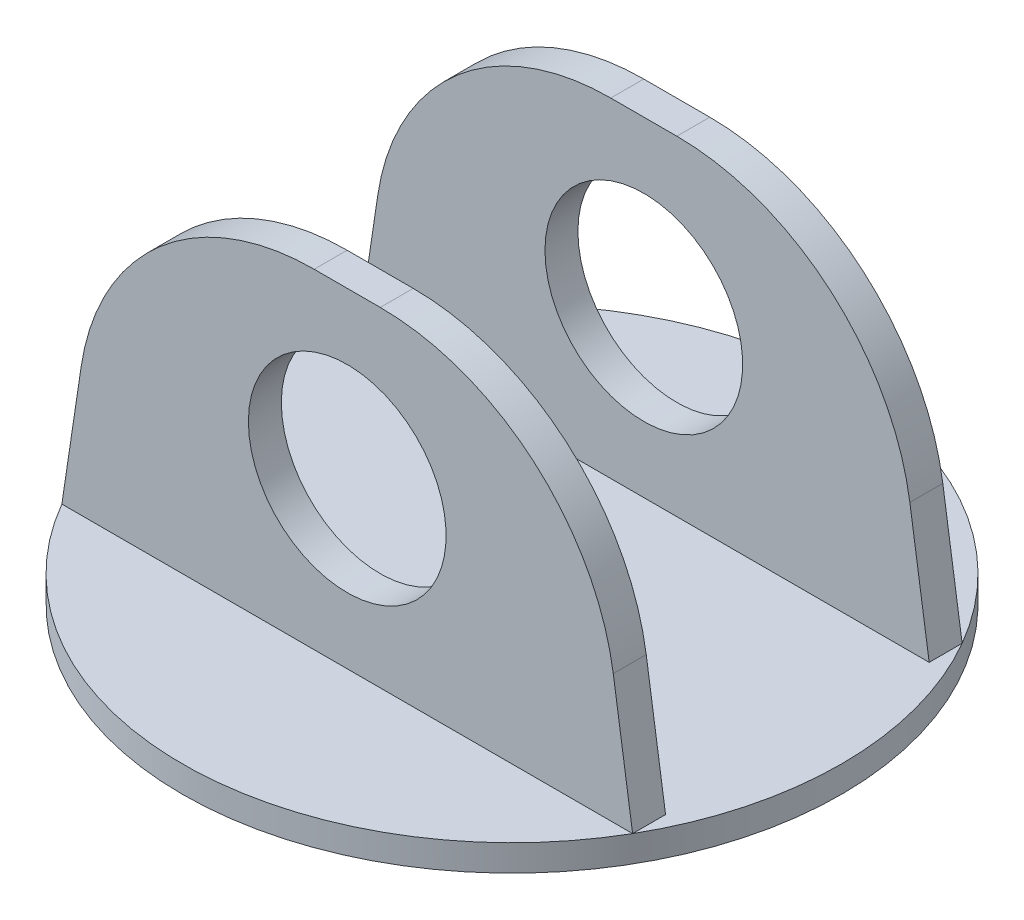
ISO-10303-21;
HEADER;
FILE_DESCRIPTION(('STEP AP214'),'2;1');
FILE_NAME('part.step','',(''),(''),'','','');
FILE_SCHEMA(('AUTOMOTIVE_DESIGN { 1 0 10303 214 1 1 1 1 }'));
ENDSEC;
DATA;
#1=APPLICATION_CONTEXT('core data for automotive mechanical design processes');
#2=APPLICATION_PROTOCOL_DEFINITION('international standard','automotive_design',2000,#1);
#3=PRODUCT_CONTEXT('',#1,'mechanical');
#4=PRODUCT('Part','Part','',(#3));
#5=PRODUCT_RELATED_PRODUCT_CATEGORY('part','',(#4));
#6=PRODUCT_DEFINITION_FORMATION('','',#4);
#7=PRODUCT_DEFINITION_CONTEXT('part definition',#1,'design');
#8=PRODUCT_DEFINITION('design','',#6,#7);
#9=PRODUCT_DEFINITION_SHAPE('','',#8);
#10=(LENGTH_UNIT() NAMED_UNIT(*) SI_UNIT(.MILLI.,.METRE.));
#11=(NAMED_UNIT(*) PLANE_ANGLE_UNIT() SI_UNIT($,.RADIAN.));
#12=(NAMED_UNIT(*) SI_UNIT($,.STERADIAN.) SOLID_ANGLE_UNIT());
#13=UNCERTAINTY_MEASURE_WITH_UNIT(LENGTH_MEASURE(1.E-05),#10,'distance_accuracy_value','');
#14=(GEOMETRIC_REPRESENTATION_CONTEXT(3) GLOBAL_UNCERTAINTY_ASSIGNED_CONTEXT((#13)) GLOBAL_UNIT_ASSIGNED_CONTEXT((#10,
#11,#12)) REPRESENTATION_CONTEXT('',''));
#15=CARTESIAN_POINT('',(0.,0.,0.));
#16=DIRECTION('',(0.,0.,1.));
#17=DIRECTION('',(1.,0.,0.));
#18=AXIS2_PLACEMENT_3D('',#15,#16,#17);
#19=CARTESIAN_POINT('',(0.,4.064,0.));
#20=DIRECTION('',(0.,1.,0.));
#21=DIRECTION('',(0.,0.,1.));
#22=AXIS2_PLACEMENT_3D('',#19,#20,#21);
#23=PLANE('',#22);
#24=CARTESIAN_POINT('',(0.,4.064,0.));
#25=DIRECTION('',(0.,1.,0.));
#26=DIRECTION('',(0.,0.,1.));
#27=AXIS2_PLACEMENT_3D('',#24,#25,#26);
#28=CIRCLE('',#27,3.175);
#29=CARTESIAN_POINT('',(0.,4.064,3.175));
#30=VERTEX_POINT('',#29);
#31=EDGE_CURVE('E453',#30,#30,#28,.T.);
#32=ORIENTED_EDGE('',*,*,#31,.F.);
#33=EDGE_LOOP('',(#32));
#34=FACE_BOUND('',#33,.T.);
#35=DIRECTION('',(1.,0.,0.));
#36=VECTOR('',#35,1.);
#37=CARTESIAN_POINT('',(0.,4.064,-20.32));
#38=LINE('',#37,#36);
#39=CARTESIAN_POINT('',(-43.9940905122495,4.064,-20.32));
#40=VERTEX_POINT('',#39);
#41=CARTESIAN_POINT('',(43.9940905122495,4.064,-20.32));
#42=VERTEX_POINT('',#41);
#43=EDGE_CURVE('E157',#40,#42,#38,.T.);
#44=ORIENTED_EDGE('',*,*,#43,.F.);
#45=DIRECTION('',(0.,0.,1.));
#46=VECTOR('',#45,1.);
#47=CARTESIAN_POINT('',(-43.9940905122495,4.064,0.));
#48=LINE('',#47,#46);
#49=CARTESIAN_POINT('',(-43.9940905122495,4.064,-25.4));
#50=VERTEX_POINT('',#49);
#51=EDGE_CURVE('E129',#50,#40,#48,.T.);
#52=ORIENTED_EDGE('',*,*,#51,.F.);
#53=CARTESIAN_POINT('',(0.,4.064,0.));
#54=DIRECTION('',(0.,1.,0.));
#55=DIRECTION('',(0.,0.,1.));
#56=AXIS2_PLACEMENT_3D('',#53,#54,#55);
#57=CIRCLE('',#56,50.8);
#58=CARTESIAN_POINT('',(-43.9940905122495,4.064,25.4));
#59=VERTEX_POINT('',#58);
#60=EDGE_CURVE('E153',#50,#59,#57,.T.);
#61=ORIENTED_EDGE('',*,*,#60,.T.);
#62=DIRECTION('',(0.,0.,-1.));
#63=VECTOR('',#62,1.);
#64=CARTESIAN_POINT('',(-43.9940905122495,4.064,0.));
#65=LINE('',#64,#63);
#66=CARTESIAN_POINT('',(-43.9940905122495,4.064,20.32));
#67=VERTEX_POINT('',#66);
#68=EDGE_CURVE('E224',#59,#67,#65,.T.);
#69=ORIENTED_EDGE('',*,*,#68,.T.);
#70=DIRECTION('',(1.,0.,0.));
#71=VECTOR('',#70,1.);
#72=CARTESIAN_POINT('',(0.,4.064,20.32));
#73=LINE('',#72,#71);
#74=CARTESIAN_POINT('',(43.9940905122495,4.064,20.32));
#75=VERTEX_POINT('',#74);
#76=EDGE_CURVE('E256',#67,#75,#73,.T.);
#77=ORIENTED_EDGE('',*,*,#76,.T.);
#78=DIRECTION('',(0.,0.,-1.));
#79=VECTOR('',#78,1.);
#80=CARTESIAN_POINT('',(43.9940905122495,4.064,0.));
#81=LINE('',#80,#79);
#82=CARTESIAN_POINT('',(43.9940905122495,4.064,25.4));
#83=VERTEX_POINT('',#82);
#84=EDGE_CURVE('E240',#83,#75,#81,.T.);
#85=ORIENTED_EDGE('',*,*,#84,.F.);
#86=CARTESIAN_POINT('',(43.9940905122495,4.064,-25.4));
#87=VERTEX_POINT('',#86);
#88=EDGE_CURVE('E169',#83,#87,#57,.T.);
#89=ORIENTED_EDGE('',*,*,#88,.T.);
#90=DIRECTION('',(0.,0.,1.));
#91=VECTOR('',#90,1.);
#92=CARTESIAN_POINT('',(43.9940905122495,4.064,0.));
#93=LINE('',#92,#91);
#94=EDGE_CURVE('E147',#87,#42,#93,.T.);
#95=ORIENTED_EDGE('',*,*,#94,.T.);
#96=EDGE_LOOP('',(#44,#52,#61,#69,#77,#85,#89,#95));
#97=FACE_BOUND('',#96,.T.);
#98=ADVANCED_FACE('F33',(#34,#97),#23,.T.);
#99=DIRECTION('',(1.,0.,0.));
#100=VECTOR('',#99,1.);
#101=CARTESIAN_POINT('',(0.,4.064,-25.4));
#102=LINE('',#101,#100);
#103=EDGE_CURVE('E139',#50,#87,#102,.T.);
#104=ORIENTED_EDGE('',*,*,#103,.T.);
#105=EDGE_CURVE('E164',#87,#50,#57,.T.);
#106=ORIENTED_EDGE('',*,*,#105,.T.);
#107=EDGE_LOOP('',(#104,#106));
#108=FACE_BOUND('',#107,.T.);
#109=ADVANCED_FACE('F170',(#108),#23,.T.);
#110=CARTESIAN_POINT('',(0.,4.064,0.));
#111=DIRECTION('',(0.,-1.,0.));
#112=DIRECTION('',(0.,0.,-1.));
#113=AXIS2_PLACEMENT_3D('',#110,#111,#112);
#114=CYLINDRICAL_SURFACE('',#113,50.8);
#115=ORIENTED_EDGE('',*,*,#88,.F.);
#116=EDGE_CURVE('E167',#59,#83,#57,.T.);
#117=ORIENTED_EDGE('',*,*,#116,.F.);
#118=ORIENTED_EDGE('',*,*,#60,.F.);
#119=ORIENTED_EDGE('',*,*,#105,.F.);
#120=EDGE_LOOP('',(#115,#117,#118,#119));
#121=FACE_BOUND('',#120,.T.);
#122=CARTESIAN_POINT('',(0.,0.,0.));
#123=DIRECTION('',(0.,1.,0.));
#124=DIRECTION('',(0.,0.,1.));
#125=AXIS2_PLACEMENT_3D('',#122,#123,#124);
#126=CIRCLE('',#125,50.8);
#127=CARTESIAN_POINT('',(0.,0.,50.8));
#128=VERTEX_POINT('',#127);
#129=EDGE_CURVE('E174',#128,#128,#126,.T.);
#130=ORIENTED_EDGE('',*,*,#129,.T.);
#131=EDGE_LOOP('',(#130));
#132=FACE_BOUND('',#131,.T.);
#133=ADVANCED_FACE('F162',(#121,#132),#114,.T.);
#134=DIRECTION('',(1.,0.,0.));
#135=VECTOR('',#134,1.);
#136=CARTESIAN_POINT('',(0.,4.064,25.4));
#137=LINE('',#136,#135);
#138=EDGE_CURVE('E259',#59,#83,#137,.T.);
#139=ORIENTED_EDGE('',*,*,#138,.F.);
#140=ORIENTED_EDGE('',*,*,#116,.T.);
#141=EDGE_LOOP('',(#139,#140));
#142=FACE_BOUND('',#141,.T.);
#143=ADVANCED_FACE('F261',(#142),#23,.T.);
#144=CARTESIAN_POINT('',(0.,0.,0.));
#145=DIRECTION('',(0.,1.,0.));
#146=DIRECTION('',(0.,0.,1.));
#147=AXIS2_PLACEMENT_3D('',#144,#145,#146);
#148=PLANE('',#147);
#149=CARTESIAN_POINT('',(0.,0.,0.));
#150=DIRECTION('',(0.,1.,0.));
#151=DIRECTION('',(0.,0.,1.));
#152=AXIS2_PLACEMENT_3D('',#149,#150,#151);
#153=CIRCLE('',#152,3.175);
#154=CARTESIAN_POINT('',(0.,0.,3.175));
#155=VERTEX_POINT('',#154);
#156=EDGE_CURVE('E450',#155,#155,#153,.T.);
#157=ORIENTED_EDGE('',*,*,#156,.T.);
#158=EDGE_LOOP('',(#157));
#159=FACE_BOUND('',#158,.T.);
#160=ORIENTED_EDGE('',*,*,#129,.F.);
#161=EDGE_LOOP('',(#160));
#162=FACE_BOUND('',#161,.T.);
#163=ADVANCED_FACE('F263',(#159,#162),#148,.F.);
#164=CARTESIAN_POINT('',(0.,54.864,25.4));
#165=DIRECTION('',(0.,0.,-1.));
#166=DIRECTION('',(-1.,0.,0.));
#167=AXIS2_PLACEMENT_3D('',#164,#165,#166);
#168=PLANE('',#167);
#169=CARTESIAN_POINT('',(0.,29.464,25.4));
#170=DIRECTION('',(0.,0.,-1.));
#171=DIRECTION('',(-1.,0.,0.));
#172=AXIS2_PLACEMENT_3D('',#169,#170,#171);
#173=CIRCLE('',#172,15.24);
#174=CARTESIAN_POINT('',(-15.24,29.464,25.4));
#175=VERTEX_POINT('',#174);
#176=EDGE_CURVE('E135',#175,#175,#173,.T.);
#177=ORIENTED_EDGE('',*,*,#176,.T.);
#178=EDGE_LOOP('',(#177));
#179=FACE_BOUND('',#178,.T.);
#180=DIRECTION('',(1.,0.,0.));
#181=VECTOR('',#180,1.);
#182=CARTESIAN_POINT('',(0.,54.864,25.4));
#183=LINE('',#182,#181);
#184=CARTESIAN_POINT('',(-5.09404101366733,54.864,25.4));
#185=VERTEX_POINT('',#184);
#186=CARTESIAN_POINT('',(5.09404101366733,54.864,25.4));
#187=VERTEX_POINT('',#186);
#188=EDGE_CURVE('E181',#185,#187,#183,.T.);
#189=ORIENTED_EDGE('',*,*,#188,.F.);
#190=CARTESIAN_POINT('',(-5.09404101366733,18.542,25.4));
#191=DIRECTION('',(0.,0.,-1.));
#192=DIRECTION('',(-1.,0.,0.));
#193=AXIS2_PLACEMENT_3D('',#190,#191,#192);
#194=CIRCLE('',#193,36.322);
#195=CARTESIAN_POINT('',(-41.0141872225496,23.9300219313323,25.4));
#196=VERTEX_POINT('',#195);
#197=EDGE_CURVE('E42',#185,#196,#194,.F.);
#198=ORIENTED_EDGE('',*,*,#197,.T.);
#199=DIRECTION('',(-0.148340452930245,-0.988936352868298,0.));
#200=VECTOR('',#199,1.);
#201=CARTESIAN_POINT('',(-35.5736826525667,60.200052397885,25.4));
#202=LINE('',#201,#200);
#203=EDGE_CURVE('E216',#196,#59,#202,.T.);
#204=ORIENTED_EDGE('',*,*,#203,.T.);
#205=ORIENTED_EDGE('',*,*,#138,.T.);
#206=DIRECTION('',(-0.148340452930245,0.988936352868298,0.));
#207=VECTOR('',#206,1.);
#208=CARTESIAN_POINT('',(35.5736826525667,60.200052397885,25.4));
#209=LINE('',#208,#207);
#210=CARTESIAN_POINT('',(41.0141872225496,23.9300219313323,25.4));
#211=VERTEX_POINT('',#210);
#212=EDGE_CURVE('E241',#83,#211,#209,.T.);
#213=ORIENTED_EDGE('',*,*,#212,.T.);
#214=CARTESIAN_POINT('',(5.09404101366733,18.542,25.4));
#215=DIRECTION('',(0.,0.,-1.));
#216=DIRECTION('',(-1.,0.,0.));
#217=AXIS2_PLACEMENT_3D('',#214,#215,#216);
#218=CIRCLE('',#217,36.322);
#219=EDGE_CURVE('E54',#211,#187,#218,.F.);
#220=ORIENTED_EDGE('',*,*,#219,.T.);
#221=EDGE_LOOP('',(#189,#198,#204,#205,#213,#220));
#222=FACE_BOUND('',#221,.T.);
#223=ADVANCED_FACE('F214',(#179,#222),#168,.F.);
#224=CARTESIAN_POINT('',(0.,54.864,20.32));
#225=DIRECTION('',(0.,0.,-1.));
#226=DIRECTION('',(-1.,0.,0.));
#227=AXIS2_PLACEMENT_3D('',#224,#225,#226);
#228=PLANE('',#227);
#229=CARTESIAN_POINT('',(0.,29.464,20.32));
#230=DIRECTION('',(0.,0.,-1.));
#231=DIRECTION('',(-1.,0.,0.));
#232=AXIS2_PLACEMENT_3D('',#229,#230,#231);
#233=CIRCLE('',#232,15.24);
#234=CARTESIAN_POINT('',(-15.24,29.464,20.32));
#235=VERTEX_POINT('',#234);
#236=EDGE_CURVE('E460',#235,#235,#233,.T.);
#237=ORIENTED_EDGE('',*,*,#236,.F.);
#238=EDGE_LOOP('',(#237));
#239=FACE_BOUND('',#238,.T.);
#240=DIRECTION('',(-0.148340452930245,-0.988936352868298,0.));
#241=VECTOR('',#240,1.);
#242=CARTESIAN_POINT('',(-35.5736826525667,60.200052397885,20.32));
#243=LINE('',#242,#241);
#244=CARTESIAN_POINT('',(-41.0141872225496,23.9300219313323,20.32));
#245=VERTEX_POINT('',#244);
#246=EDGE_CURVE('E225',#245,#67,#243,.T.);
#247=ORIENTED_EDGE('',*,*,#246,.F.);
#248=CARTESIAN_POINT('',(-5.09404101366733,18.542,20.32));
#249=DIRECTION('',(0.,0.,-1.));
#250=DIRECTION('',(-1.,0.,0.));
#251=AXIS2_PLACEMENT_3D('',#248,#249,#250);
#252=CIRCLE('',#251,36.322);
#253=CARTESIAN_POINT('',(-5.09404101366733,54.864,20.32));
#254=VERTEX_POINT('',#253);
#255=EDGE_CURVE('E204',#245,#254,#252,.T.);
#256=ORIENTED_EDGE('',*,*,#255,.T.);
#257=DIRECTION('',(1.,0.,0.));
#258=VECTOR('',#257,1.);
#259=CARTESIAN_POINT('',(0.,54.864,20.32));
#260=LINE('',#259,#258);
#261=CARTESIAN_POINT('',(5.09404101366733,54.864,20.32));
#262=VERTEX_POINT('',#261);
#263=EDGE_CURVE('E178',#254,#262,#260,.T.);
#264=ORIENTED_EDGE('',*,*,#263,.T.);
#265=CARTESIAN_POINT('',(5.09404101366733,18.542,20.32));
#266=DIRECTION('',(0.,0.,-1.));
#267=DIRECTION('',(-1.,0.,0.));
#268=AXIS2_PLACEMENT_3D('',#265,#266,#267);
#269=CIRCLE('',#268,36.322);
#270=CARTESIAN_POINT('',(41.0141872225496,23.9300219313323,20.32));
#271=VERTEX_POINT('',#270);
#272=EDGE_CURVE('E202',#262,#271,#269,.T.);
#273=ORIENTED_EDGE('',*,*,#272,.T.);
#274=DIRECTION('',(-0.148340452930245,0.988936352868298,0.));
#275=VECTOR('',#274,1.);
#276=CARTESIAN_POINT('',(35.5736826525667,60.200052397885,20.32));
#277=LINE('',#276,#275);
#278=EDGE_CURVE('E237',#75,#271,#277,.T.);
#279=ORIENTED_EDGE('',*,*,#278,.F.);
#280=ORIENTED_EDGE('',*,*,#76,.F.);
#281=EDGE_LOOP('',(#247,#256,#264,#273,#279,#280));
#282=FACE_BOUND('',#281,.T.);
#283=ADVANCED_FACE('F230',(#239,#282),#228,.T.);
#284=CARTESIAN_POINT('',(0.,54.864,0.));
#285=DIRECTION('',(0.,1.,0.));
#286=DIRECTION('',(0.,0.,1.));
#287=AXIS2_PLACEMENT_3D('',#284,#285,#286);
#288=PLANE('',#287);
#289=ORIENTED_EDGE('',*,*,#263,.F.);
#290=DIRECTION('',(0.,0.,-1.));
#291=VECTOR('',#290,1.);
#292=CARTESIAN_POINT('',(-5.09404101366733,54.864,25.4));
#293=LINE('',#292,#291);
#294=EDGE_CURVE('E209',#254,#185,#293,.F.);
#295=ORIENTED_EDGE('',*,*,#294,.T.);
#296=ORIENTED_EDGE('',*,*,#188,.T.);
#297=DIRECTION('',(0.,0.,-1.));
#298=VECTOR('',#297,1.);
#299=CARTESIAN_POINT('',(5.09404101366733,54.864,20.32));
#300=LINE('',#299,#298);
#301=EDGE_CURVE('E206',#187,#262,#300,.T.);
#302=ORIENTED_EDGE('',*,*,#301,.T.);
#303=EDGE_LOOP('',(#289,#295,#296,#302));
#304=FACE_BOUND('',#303,.T.);
#305=ADVANCED_FACE('F233',(#304),#288,.T.);
#306=CARTESIAN_POINT('',(0.,54.864,-25.4));
#307=DIRECTION('',(0.,0.,-1.));
#308=DIRECTION('',(-1.,0.,0.));
#309=AXIS2_PLACEMENT_3D('',#306,#307,#308);
#310=PLANE('',#309);
#311=CARTESIAN_POINT('',(0.,29.464,-25.4));
#312=DIRECTION('',(0.,0.,-1.));
#313=DIRECTION('',(-1.,0.,0.));
#314=AXIS2_PLACEMENT_3D('',#311,#312,#313);
#315=CIRCLE('',#314,15.24);
#316=CARTESIAN_POINT('',(-15.24,29.464,-25.4));
#317=VERTEX_POINT('',#316);
#318=EDGE_CURVE('E455',#317,#317,#315,.T.);
#319=ORIENTED_EDGE('',*,*,#318,.F.);
#320=EDGE_LOOP('',(#319));
#321=FACE_BOUND('',#320,.T.);
#322=DIRECTION('',(1.,0.,0.));
#323=VECTOR('',#322,1.);
#324=CARTESIAN_POINT('',(0.,54.864,-25.4));
#325=LINE('',#324,#323);
#326=CARTESIAN_POINT('',(-5.09404101366733,54.864,-25.4));
#327=VERTEX_POINT('',#326);
#328=CARTESIAN_POINT('',(5.09404101366733,54.864,-25.4));
#329=VERTEX_POINT('',#328);
#330=EDGE_CURVE('E249',#327,#329,#325,.T.);
#331=ORIENTED_EDGE('',*,*,#330,.T.);
#332=CARTESIAN_POINT('',(5.09404101366733,18.542,-25.4));
#333=DIRECTION('',(0.,0.,-1.));
#334=DIRECTION('',(-1.,0.,0.));
#335=AXIS2_PLACEMENT_3D('',#332,#333,#334);
#336=CIRCLE('',#335,36.322);
#337=CARTESIAN_POINT('',(41.0141872225496,23.9300219313323,-25.4));
#338=VERTEX_POINT('',#337);
#339=EDGE_CURVE('E196',#329,#338,#336,.T.);
#340=ORIENTED_EDGE('',*,*,#339,.T.);
#341=DIRECTION('',(-0.148340452930245,0.988936352868298,0.));
#342=VECTOR('',#341,1.);
#343=CARTESIAN_POINT('',(36.3740905122495,54.864,-25.4));
#344=LINE('',#343,#342);
#345=EDGE_CURVE('E143',#87,#338,#344,.T.);
#346=ORIENTED_EDGE('',*,*,#345,.F.);
#347=ORIENTED_EDGE('',*,*,#103,.F.);
#348=DIRECTION('',(-0.148340452930245,-0.988936352868298,0.));
#349=VECTOR('',#348,1.);
#350=CARTESIAN_POINT('',(-43.9940905122495,4.064,-25.4));
#351=LINE('',#350,#349);
#352=CARTESIAN_POINT('',(-41.0141872225496,23.9300219313323,-25.4));
#353=VERTEX_POINT('',#352);
#354=EDGE_CURVE('E124',#353,#50,#351,.T.);
#355=ORIENTED_EDGE('',*,*,#354,.F.);
#356=CARTESIAN_POINT('',(-5.09404101366733,18.542,-25.4));
#357=DIRECTION('',(0.,0.,-1.));
#358=DIRECTION('',(-1.,0.,0.));
#359=AXIS2_PLACEMENT_3D('',#356,#357,#358);
#360=CIRCLE('',#359,36.322);
#361=EDGE_CURVE('E194',#353,#327,#360,.T.);
#362=ORIENTED_EDGE('',*,*,#361,.T.);
#363=EDGE_LOOP('',(#331,#340,#346,#347,#355,#362));
#364=FACE_BOUND('',#363,.T.);
#365=ADVANCED_FACE('F141',(#321,#364),#310,.T.);
#366=CARTESIAN_POINT('',(0.,54.864,-20.32));
#367=DIRECTION('',(0.,0.,-1.));
#368=DIRECTION('',(-1.,0.,0.));
#369=AXIS2_PLACEMENT_3D('',#366,#367,#368);
#370=PLANE('',#369);
#371=CARTESIAN_POINT('',(0.,29.464,-20.32));
#372=DIRECTION('',(0.,0.,-1.));
#373=DIRECTION('',(-1.,0.,0.));
#374=AXIS2_PLACEMENT_3D('',#371,#372,#373);
#375=CIRCLE('',#374,15.24);
#376=CARTESIAN_POINT('',(-15.24,29.464,-20.32));
#377=VERTEX_POINT('',#376);
#378=EDGE_CURVE('E37',#377,#377,#375,.T.);
#379=ORIENTED_EDGE('',*,*,#378,.T.);
#380=EDGE_LOOP('',(#379));
#381=FACE_BOUND('',#380,.T.);
#382=DIRECTION('',(-0.148340452930245,0.988936352868298,0.));
#383=VECTOR('',#382,1.);
#384=CARTESIAN_POINT('',(35.5736826525667,60.200052397885,-20.32));
#385=LINE('',#384,#383);
#386=CARTESIAN_POINT('',(41.0141872225496,23.9300219313323,-20.32));
#387=VERTEX_POINT('',#386);
#388=EDGE_CURVE('E242',#42,#387,#385,.T.);
#389=ORIENTED_EDGE('',*,*,#388,.T.);
#390=CARTESIAN_POINT('',(5.09404101366733,18.542,-20.32));
#391=DIRECTION('',(0.,0.,-1.));
#392=DIRECTION('',(-1.,0.,0.));
#393=AXIS2_PLACEMENT_3D('',#390,#391,#392);
#394=CIRCLE('',#393,36.322);
#395=CARTESIAN_POINT('',(5.09404101366733,54.864,-20.32));
#396=VERTEX_POINT('',#395);
#397=EDGE_CURVE('E188',#387,#396,#394,.F.);
#398=ORIENTED_EDGE('',*,*,#397,.T.);
#399=DIRECTION('',(1.,0.,0.));
#400=VECTOR('',#399,1.);
#401=CARTESIAN_POINT('',(0.,54.864,-20.32));
#402=LINE('',#401,#400);
#403=CARTESIAN_POINT('',(-5.09404101366733,54.864,-20.32));
#404=VERTEX_POINT('',#403);
#405=EDGE_CURVE('E251',#404,#396,#402,.T.);
#406=ORIENTED_EDGE('',*,*,#405,.F.);
#407=CARTESIAN_POINT('',(-5.09404101366733,18.542,-20.32));
#408=DIRECTION('',(0.,0.,-1.));
#409=DIRECTION('',(-1.,0.,0.));
#410=AXIS2_PLACEMENT_3D('',#407,#408,#409);
#411=CIRCLE('',#410,36.322);
#412=CARTESIAN_POINT('',(-41.0141872225496,23.9300219313323,-20.32));
#413=VERTEX_POINT('',#412);
#414=EDGE_CURVE('E186',#404,#413,#411,.F.);
#415=ORIENTED_EDGE('',*,*,#414,.T.);
#416=DIRECTION('',(-0.148340452930245,-0.988936352868298,0.));
#417=VECTOR('',#416,1.);
#418=CARTESIAN_POINT('',(-35.5736826525667,60.200052397885,-20.32));
#419=LINE('',#418,#417);
#420=EDGE_CURVE('E134',#413,#40,#419,.T.);
#421=ORIENTED_EDGE('',*,*,#420,.T.);
#422=ORIENTED_EDGE('',*,*,#43,.T.);
#423=EDGE_LOOP('',(#389,#398,#406,#415,#421,#422));
#424=FACE_BOUND('',#423,.T.);
#425=ADVANCED_FACE('F314',(#381,#424),#370,.F.);
#426=CARTESIAN_POINT('',(0.,54.864,0.));
#427=DIRECTION('',(0.,1.,0.));
#428=DIRECTION('',(0.,0.,1.));
#429=AXIS2_PLACEMENT_3D('',#426,#427,#428);
#430=PLANE('',#429);
#431=ORIENTED_EDGE('',*,*,#405,.T.);
#432=DIRECTION('',(0.,0.,1.));
#433=VECTOR('',#432,1.);
#434=CARTESIAN_POINT('',(5.09404101366733,54.864,-25.4));
#435=LINE('',#434,#433);
#436=EDGE_CURVE('E192',#396,#329,#435,.F.);
#437=ORIENTED_EDGE('',*,*,#436,.T.);
#438=ORIENTED_EDGE('',*,*,#330,.F.);
#439=DIRECTION('',(0.,0.,-1.));
#440=VECTOR('',#439,1.);
#441=CARTESIAN_POINT('',(-5.09404101366733,54.864,-20.32));
#442=LINE('',#441,#440);
#443=EDGE_CURVE('E190',#327,#404,#442,.F.);
#444=ORIENTED_EDGE('',*,*,#443,.T.);
#445=EDGE_LOOP('',(#431,#437,#438,#444));
#446=FACE_BOUND('',#445,.T.);
#447=ADVANCED_FACE('F308',(#446),#430,.T.);
#448=CARTESIAN_POINT('',(36.3740905122495,54.864,50.8));
#449=DIRECTION('',(-0.988936352868298,-0.148340452930245,0.));
#450=DIRECTION('',(0.148340452930245,-0.988936352868298,0.));
#451=AXIS2_PLACEMENT_3D('',#448,#449,#450);
#452=PLANE('',#451);
#453=ORIENTED_EDGE('',*,*,#345,.T.);
#454=DIRECTION('',(0.,0.,1.));
#455=VECTOR('',#454,1.);
#456=CARTESIAN_POINT('',(41.0141872225496,23.9300219313323,-20.32));
#457=LINE('',#456,#455);
#458=EDGE_CURVE('E171',#338,#387,#457,.T.);
#459=ORIENTED_EDGE('',*,*,#458,.T.);
#460=ORIENTED_EDGE('',*,*,#388,.F.);
#461=ORIENTED_EDGE('',*,*,#94,.F.);
#462=EDGE_LOOP('',(#453,#459,#460,#461));
#463=FACE_BOUND('',#462,.T.);
#464=ADVANCED_FACE('F313',(#463),#452,.F.);
#465=ORIENTED_EDGE('',*,*,#278,.T.);
#466=DIRECTION('',(0.,0.,-1.));
#467=VECTOR('',#466,1.);
#468=CARTESIAN_POINT('',(41.0141872225496,23.9300219313323,25.4));
#469=LINE('',#468,#467);
#470=EDGE_CURVE('E11',#271,#211,#469,.F.);
#471=ORIENTED_EDGE('',*,*,#470,.T.);
#472=ORIENTED_EDGE('',*,*,#212,.F.);
#473=ORIENTED_EDGE('',*,*,#84,.T.);
#474=EDGE_LOOP('',(#465,#471,#472,#473));
#475=FACE_BOUND('',#474,.T.);
#476=ADVANCED_FACE('F239',(#475),#452,.F.);
#477=CARTESIAN_POINT('',(-43.9940905122495,4.064,50.8));
#478=DIRECTION('',(0.988936352868298,-0.148340452930245,0.));
#479=DIRECTION('',(0.148340452930245,0.988936352868298,0.));
#480=AXIS2_PLACEMENT_3D('',#477,#478,#479);
#481=PLANE('',#480);
#482=ORIENTED_EDGE('',*,*,#420,.F.);
#483=DIRECTION('',(0.,0.,-1.));
#484=VECTOR('',#483,1.);
#485=CARTESIAN_POINT('',(-41.0141872225496,23.9300219313323,-25.4));
#486=LINE('',#485,#484);
#487=EDGE_CURVE('E132',#413,#353,#486,.T.);
#488=ORIENTED_EDGE('',*,*,#487,.T.);
#489=ORIENTED_EDGE('',*,*,#354,.T.);
#490=ORIENTED_EDGE('',*,*,#51,.T.);
#491=EDGE_LOOP('',(#482,#488,#489,#490));
#492=FACE_BOUND('',#491,.T.);
#493=ADVANCED_FACE('F127',(#492),#481,.F.);
#494=ORIENTED_EDGE('',*,*,#203,.F.);
#495=DIRECTION('',(0.,0.,-1.));
#496=VECTOR('',#495,1.);
#497=CARTESIAN_POINT('',(-41.0141872225496,23.9300219313323,20.32));
#498=LINE('',#497,#496);
#499=EDGE_CURVE('E199',#196,#245,#498,.T.);
#500=ORIENTED_EDGE('',*,*,#499,.T.);
#501=ORIENTED_EDGE('',*,*,#246,.T.);
#502=ORIENTED_EDGE('',*,*,#68,.F.);
#503=EDGE_LOOP('',(#494,#500,#501,#502));
#504=FACE_BOUND('',#503,.T.);
#505=ADVANCED_FACE('F222',(#504),#481,.F.);
#506=CARTESIAN_POINT('',(5.09404101366733,18.542,50.8));
#507=DIRECTION('',(0.,0.,-1.));
#508=DIRECTION('',(-1.,0.,0.));
#509=AXIS2_PLACEMENT_3D('',#506,#507,#508);
#510=CYLINDRICAL_SURFACE('',#509,36.322);
#511=ORIENTED_EDGE('',*,*,#339,.F.);
#512=ORIENTED_EDGE('',*,*,#436,.F.);
#513=ORIENTED_EDGE('',*,*,#397,.F.);
#514=ORIENTED_EDGE('',*,*,#458,.F.);
#515=EDGE_LOOP('',(#511,#512,#513,#514));
#516=FACE_BOUND('',#515,.T.);
#517=ADVANCED_FACE('F350',(#516),#510,.T.);
#518=CARTESIAN_POINT('',(-5.09404101366733,18.542,50.8));
#519=DIRECTION('',(0.,0.,1.));
#520=DIRECTION('',(1.,0.,0.));
#521=AXIS2_PLACEMENT_3D('',#518,#519,#520);
#522=CYLINDRICAL_SURFACE('',#521,36.322);
#523=ORIENTED_EDGE('',*,*,#414,.F.);
#524=ORIENTED_EDGE('',*,*,#443,.F.);
#525=ORIENTED_EDGE('',*,*,#361,.F.);
#526=ORIENTED_EDGE('',*,*,#487,.F.);
#527=EDGE_LOOP('',(#523,#524,#525,#526));
#528=FACE_BOUND('',#527,.T.);
#529=ADVANCED_FACE('F358',(#528),#522,.T.);
#530=CARTESIAN_POINT('',(-5.09404101366733,18.542,50.8));
#531=DIRECTION('',(0.,0.,1.));
#532=DIRECTION('',(1.,0.,0.));
#533=AXIS2_PLACEMENT_3D('',#530,#531,#532);
#534=CYLINDRICAL_SURFACE('',#533,36.322);
#535=ORIENTED_EDGE('',*,*,#197,.F.);
#536=ORIENTED_EDGE('',*,*,#294,.F.);
#537=ORIENTED_EDGE('',*,*,#255,.F.);
#538=ORIENTED_EDGE('',*,*,#499,.F.);
#539=EDGE_LOOP('',(#535,#536,#537,#538));
#540=FACE_BOUND('',#539,.T.);
#541=ADVANCED_FACE('F227',(#540),#534,.T.);
#542=CARTESIAN_POINT('',(5.09404101366733,18.542,0.));
#543=DIRECTION('',(0.,0.,1.));
#544=DIRECTION('',(1.,0.,0.));
#545=AXIS2_PLACEMENT_3D('',#542,#543,#544);
#546=CYLINDRICAL_SURFACE('',#545,36.322);
#547=ORIENTED_EDGE('',*,*,#219,.F.);
#548=ORIENTED_EDGE('',*,*,#470,.F.);
#549=ORIENTED_EDGE('',*,*,#272,.F.);
#550=ORIENTED_EDGE('',*,*,#301,.F.);
#551=EDGE_LOOP('',(#547,#548,#549,#550));
#552=FACE_BOUND('',#551,.T.);
#553=ADVANCED_FACE('F35',(#552),#546,.T.);
#554=CARTESIAN_POINT('',(0.,29.464,50.8));
#555=DIRECTION('',(0.,0.,-1.));
#556=DIRECTION('',(-1.,0.,0.));
#557=AXIS2_PLACEMENT_3D('',#554,#555,#556);
#558=CYLINDRICAL_SURFACE('',#557,15.24);
#559=ORIENTED_EDGE('',*,*,#318,.T.);
#560=EDGE_LOOP('',(#559));
#561=FACE_BOUND('',#560,.T.);
#562=ORIENTED_EDGE('',*,*,#378,.F.);
#563=EDGE_LOOP('',(#562));
#564=FACE_BOUND('',#563,.T.);
#565=ADVANCED_FACE('F384',(#561,#564),#558,.F.);
#566=ORIENTED_EDGE('',*,*,#236,.T.);
#567=EDGE_LOOP('',(#566));
#568=FACE_BOUND('',#567,.T.);
#569=ORIENTED_EDGE('',*,*,#176,.F.);
#570=EDGE_LOOP('',(#569));
#571=FACE_BOUND('',#570,.T.);
#572=ADVANCED_FACE('F421',(#568,#571),#558,.F.);
#573=CARTESIAN_POINT('',(0.,0.,0.));
#574=DIRECTION('',(0.,1.,0.));
#575=DIRECTION('',(0.,0.,1.));
#576=AXIS2_PLACEMENT_3D('',#573,#574,#575);
#577=CYLINDRICAL_SURFACE('',#576,3.175);
#578=ORIENTED_EDGE('',*,*,#156,.F.);
#579=EDGE_LOOP('',(#578));
#580=FACE_BOUND('',#579,.T.);
#581=ORIENTED_EDGE('',*,*,#31,.T.);
#582=EDGE_LOOP('',(#581));
#583=FACE_BOUND('',#582,.T.);
#584=ADVANCED_FACE('F430',(#580,#583),#577,.F.);
#585=CLOSED_SHELL('',(#98,#109,#133,#143,#163,#223,#283,#305,#365,#425,#447,#464,#476,#493,#505,
#517,#529,#541,#553,#565,#572,#584));
#586=MANIFOLD_SOLID_BREP('B2',#585);
#587=ADVANCED_BREP_SHAPE_REPRESENTATION('',(#18,#586),#14);
#588=SHAPE_DEFINITION_REPRESENTATION(#9,#587);
ENDSEC;
END-ISO-10303-21;
